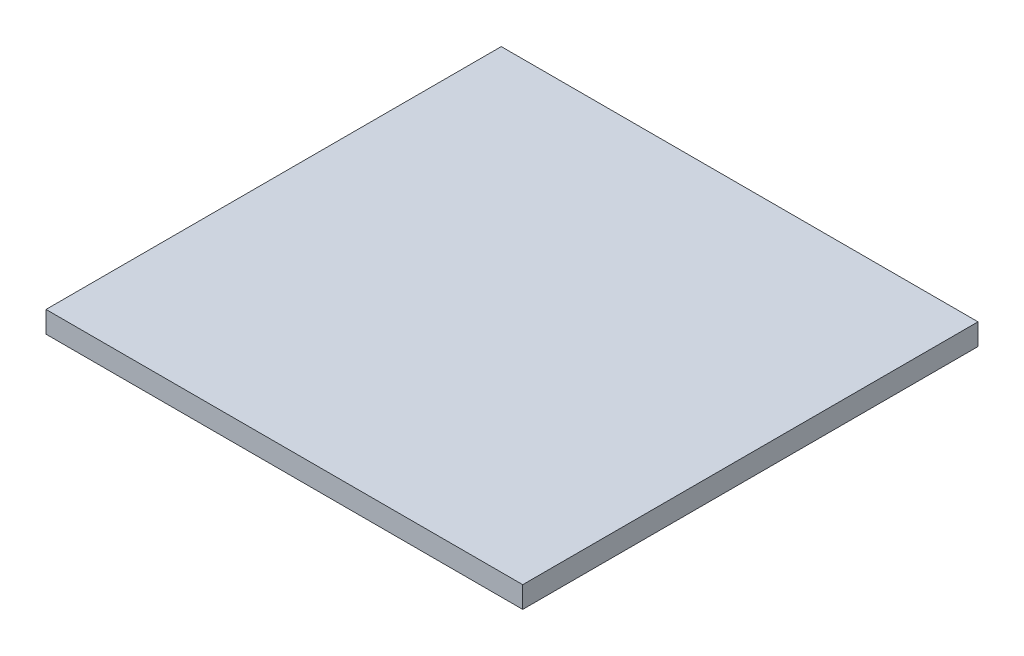
ISO-10303-21;
HEADER;
FILE_DESCRIPTION(('STEP AP214'),'2;1');
FILE_NAME('part.step','',(''),(''),'','','');
FILE_SCHEMA(('AUTOMOTIVE_DESIGN { 1 0 10303 214 1 1 1 1 }'));
ENDSEC;
DATA;
#1=APPLICATION_CONTEXT('core data for automotive mechanical design processes');
#2=APPLICATION_PROTOCOL_DEFINITION('international standard','automotive_design',2000,#1);
#3=PRODUCT_CONTEXT('',#1,'mechanical');
#4=PRODUCT('Part','Part','',(#3));
#5=PRODUCT_RELATED_PRODUCT_CATEGORY('part','',(#4));
#6=PRODUCT_DEFINITION_FORMATION('','',#4);
#7=PRODUCT_DEFINITION_CONTEXT('part definition',#1,'design');
#8=PRODUCT_DEFINITION('design','',#6,#7);
#9=PRODUCT_DEFINITION_SHAPE('','',#8);
#10=(LENGTH_UNIT() NAMED_UNIT(*) SI_UNIT(.MILLI.,.METRE.));
#11=(NAMED_UNIT(*) PLANE_ANGLE_UNIT() SI_UNIT($,.RADIAN.));
#12=(NAMED_UNIT(*) SI_UNIT($,.STERADIAN.) SOLID_ANGLE_UNIT());
#13=UNCERTAINTY_MEASURE_WITH_UNIT(LENGTH_MEASURE(1.E-05),#10,'distance_accuracy_value','');
#14=(GEOMETRIC_REPRESENTATION_CONTEXT(3) GLOBAL_UNCERTAINTY_ASSIGNED_CONTEXT((#13)) GLOBAL_UNIT_ASSIGNED_CONTEXT((#10,
#11,#12)) REPRESENTATION_CONTEXT('',''));
#15=CARTESIAN_POINT('',(0.,0.,0.));
#16=DIRECTION('',(0.,0.,1.));
#17=DIRECTION('',(1.,0.,0.));
#18=AXIS2_PLACEMENT_3D('',#15,#16,#17);
#19=CARTESIAN_POINT('',(100.,9.,-95.5));
#20=DIRECTION('',(-1.,0.,0.));
#21=DIRECTION('',(0.,0.,1.));
#22=AXIS2_PLACEMENT_3D('',#19,#20,#21);
#23=PLANE('',#22);
#24=DIRECTION('',(0.,0.,-1.));
#25=VECTOR('',#24,1.);
#26=CARTESIAN_POINT('',(100.,0.,-95.5));
#27=LINE('',#26,#25);
#28=CARTESIAN_POINT('',(100.,0.,95.5));
#29=VERTEX_POINT('',#28);
#30=CARTESIAN_POINT('',(100.,0.,-95.5));
#31=VERTEX_POINT('',#30);
#32=EDGE_CURVE('E104',#29,#31,#27,.T.);
#33=ORIENTED_EDGE('',*,*,#32,.T.);
#34=DIRECTION('',(0.,-1.,0.));
#35=VECTOR('',#34,1.);
#36=CARTESIAN_POINT('',(100.,9.,-95.5));
#37=LINE('',#36,#35);
#38=CARTESIAN_POINT('',(100.,9.,-95.5));
#39=VERTEX_POINT('',#38);
#40=EDGE_CURVE('E11',#39,#31,#37,.T.);
#41=ORIENTED_EDGE('',*,*,#40,.F.);
#42=DIRECTION('',(0.,0.,-1.));
#43=VECTOR('',#42,1.);
#44=CARTESIAN_POINT('',(100.,9.,-95.5));
#45=LINE('',#44,#43);
#46=CARTESIAN_POINT('',(100.,9.,95.5));
#47=VERTEX_POINT('',#46);
#48=EDGE_CURVE('E92',#47,#39,#45,.T.);
#49=ORIENTED_EDGE('',*,*,#48,.F.);
#50=DIRECTION('',(0.,-1.,0.));
#51=VECTOR('',#50,1.);
#52=CARTESIAN_POINT('',(100.,9.,95.5));
#53=LINE('',#52,#51);
#54=EDGE_CURVE('E100',#47,#29,#53,.T.);
#55=ORIENTED_EDGE('',*,*,#54,.T.);
#56=EDGE_LOOP('',(#33,#41,#49,#55));
#57=FACE_BOUND('',#56,.T.);
#58=ADVANCED_FACE('F41',(#57),#23,.F.);
#59=CARTESIAN_POINT('',(-100.,9.,-95.5));
#60=DIRECTION('',(0.,0.,1.));
#61=DIRECTION('',(1.,0.,0.));
#62=AXIS2_PLACEMENT_3D('',#59,#60,#61);
#63=PLANE('',#62);
#64=DIRECTION('',(-1.,0.,0.));
#65=VECTOR('',#64,1.);
#66=CARTESIAN_POINT('',(-100.,0.,-95.5));
#67=LINE('',#66,#65);
#68=CARTESIAN_POINT('',(-100.,0.,-95.5));
#69=VERTEX_POINT('',#68);
#70=EDGE_CURVE('E96',#31,#69,#67,.T.);
#71=ORIENTED_EDGE('',*,*,#70,.T.);
#72=DIRECTION('',(0.,-1.,0.));
#73=VECTOR('',#72,1.);
#74=CARTESIAN_POINT('',(-100.,9.,-95.5));
#75=LINE('',#74,#73);
#76=CARTESIAN_POINT('',(-100.,9.,-95.5));
#77=VERTEX_POINT('',#76);
#78=EDGE_CURVE('E49',#77,#69,#75,.T.);
#79=ORIENTED_EDGE('',*,*,#78,.F.);
#80=DIRECTION('',(-1.,0.,0.));
#81=VECTOR('',#80,1.);
#82=CARTESIAN_POINT('',(-100.,9.,-95.5));
#83=LINE('',#82,#81);
#84=EDGE_CURVE('E87',#39,#77,#83,.T.);
#85=ORIENTED_EDGE('',*,*,#84,.F.);
#86=ORIENTED_EDGE('',*,*,#40,.T.);
#87=EDGE_LOOP('',(#71,#79,#85,#86));
#88=FACE_BOUND('',#87,.T.);
#89=ADVANCED_FACE('F95',(#88),#63,.F.);
#90=CARTESIAN_POINT('',(-100.,9.,-95.5));
#91=DIRECTION('',(1.,0.,0.));
#92=DIRECTION('',(0.,0.,-1.));
#93=AXIS2_PLACEMENT_3D('',#90,#91,#92);
#94=PLANE('',#93);
#95=DIRECTION('',(0.,0.,1.));
#96=VECTOR('',#95,1.);
#97=CARTESIAN_POINT('',(-100.,0.,-95.5));
#98=LINE('',#97,#96);
#99=CARTESIAN_POINT('',(-100.,0.,95.5));
#100=VERTEX_POINT('',#99);
#101=EDGE_CURVE('E74',#69,#100,#98,.T.);
#102=ORIENTED_EDGE('',*,*,#101,.T.);
#103=DIRECTION('',(0.,-1.,0.));
#104=VECTOR('',#103,1.);
#105=CARTESIAN_POINT('',(-100.,9.,95.5));
#106=LINE('',#105,#104);
#107=CARTESIAN_POINT('',(-100.,9.,95.5));
#108=VERTEX_POINT('',#107);
#109=EDGE_CURVE('E97',#108,#100,#106,.T.);
#110=ORIENTED_EDGE('',*,*,#109,.F.);
#111=DIRECTION('',(0.,0.,1.));
#112=VECTOR('',#111,1.);
#113=CARTESIAN_POINT('',(-100.,9.,-95.5));
#114=LINE('',#113,#112);
#115=EDGE_CURVE('E90',#77,#108,#114,.T.);
#116=ORIENTED_EDGE('',*,*,#115,.F.);
#117=ORIENTED_EDGE('',*,*,#78,.T.);
#118=EDGE_LOOP('',(#102,#110,#116,#117));
#119=FACE_BOUND('',#118,.T.);
#120=ADVANCED_FACE('F98',(#119),#94,.F.);
#121=CARTESIAN_POINT('',(-100.,9.,95.5));
#122=DIRECTION('',(0.,0.,-1.));
#123=DIRECTION('',(-1.,0.,0.));
#124=AXIS2_PLACEMENT_3D('',#121,#122,#123);
#125=PLANE('',#124);
#126=DIRECTION('',(1.,0.,0.));
#127=VECTOR('',#126,1.);
#128=CARTESIAN_POINT('',(-100.,0.,95.5));
#129=LINE('',#128,#127);
#130=EDGE_CURVE('E80',#100,#29,#129,.T.);
#131=ORIENTED_EDGE('',*,*,#130,.T.);
#132=ORIENTED_EDGE('',*,*,#54,.F.);
#133=DIRECTION('',(1.,0.,0.));
#134=VECTOR('',#133,1.);
#135=CARTESIAN_POINT('',(-100.,9.,95.5));
#136=LINE('',#135,#134);
#137=EDGE_CURVE('E57',#108,#47,#136,.T.);
#138=ORIENTED_EDGE('',*,*,#137,.F.);
#139=ORIENTED_EDGE('',*,*,#109,.T.);
#140=EDGE_LOOP('',(#131,#132,#138,#139));
#141=FACE_BOUND('',#140,.T.);
#142=ADVANCED_FACE('F111',(#141),#125,.F.);
#143=CARTESIAN_POINT('',(0.,9.,0.));
#144=DIRECTION('',(0.,1.,0.));
#145=DIRECTION('',(0.,0.,1.));
#146=AXIS2_PLACEMENT_3D('',#143,#144,#145);
#147=PLANE('',#146);
#148=ORIENTED_EDGE('',*,*,#48,.T.);
#149=ORIENTED_EDGE('',*,*,#84,.T.);
#150=ORIENTED_EDGE('',*,*,#115,.T.);
#151=ORIENTED_EDGE('',*,*,#137,.T.);
#152=EDGE_LOOP('',(#148,#149,#150,#151));
#153=FACE_BOUND('',#152,.T.);
#154=ADVANCED_FACE('F88',(#153),#147,.T.);
#155=CARTESIAN_POINT('',(0.,0.,0.));
#156=DIRECTION('',(0.,1.,0.));
#157=DIRECTION('',(0.,0.,1.));
#158=AXIS2_PLACEMENT_3D('',#155,#156,#157);
#159=PLANE('',#158);
#160=ORIENTED_EDGE('',*,*,#32,.F.);
#161=ORIENTED_EDGE('',*,*,#130,.F.);
#162=ORIENTED_EDGE('',*,*,#101,.F.);
#163=ORIENTED_EDGE('',*,*,#70,.F.);
#164=EDGE_LOOP('',(#160,#161,#162,#163));
#165=FACE_BOUND('',#164,.T.);
#166=ADVANCED_FACE('F114',(#165),#159,.F.);
#167=CLOSED_SHELL('',(#58,#89,#120,#142,#154,#166));
#168=MANIFOLD_SOLID_BREP('B2',#167);
#169=ADVANCED_BREP_SHAPE_REPRESENTATION('',(#18,#168),#14);
#170=SHAPE_DEFINITION_REPRESENTATION(#9,#169);
ENDSEC;
END-ISO-10303-21;
